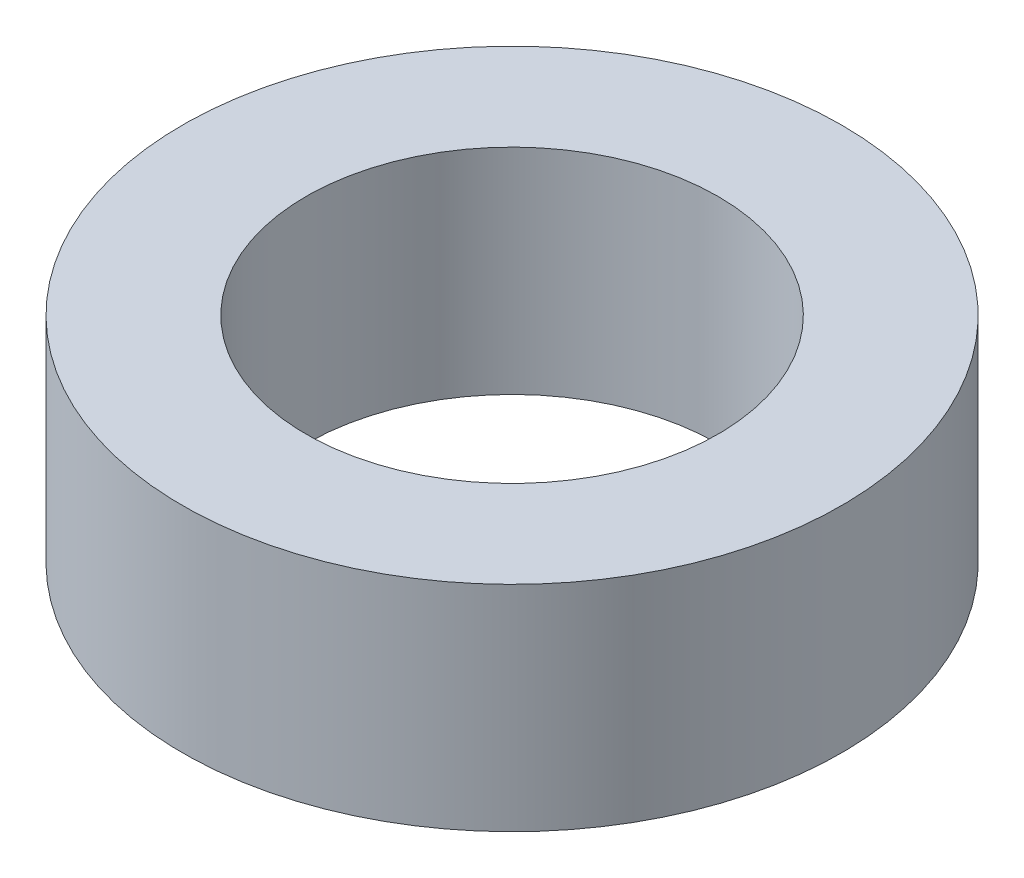
ISO-10303-21;
HEADER;
FILE_DESCRIPTION(('STEP AP214'),'2;1');
FILE_NAME('part.step','',(''),(''),'','','');
FILE_SCHEMA(('AUTOMOTIVE_DESIGN { 1 0 10303 214 1 1 1 1 }'));
ENDSEC;
DATA;
#1=APPLICATION_CONTEXT('core data for automotive mechanical design processes');
#2=APPLICATION_PROTOCOL_DEFINITION('international standard','automotive_design',2000,#1);
#3=PRODUCT_CONTEXT('',#1,'mechanical');
#4=PRODUCT('Part','Part','',(#3));
#5=PRODUCT_RELATED_PRODUCT_CATEGORY('part','',(#4));
#6=PRODUCT_DEFINITION_FORMATION('','',#4);
#7=PRODUCT_DEFINITION_CONTEXT('part definition',#1,'design');
#8=PRODUCT_DEFINITION('design','',#6,#7);
#9=PRODUCT_DEFINITION_SHAPE('','',#8);
#10=(LENGTH_UNIT() NAMED_UNIT(*) SI_UNIT(.MILLI.,.METRE.));
#11=(NAMED_UNIT(*) PLANE_ANGLE_UNIT() SI_UNIT($,.RADIAN.));
#12=(NAMED_UNIT(*) SI_UNIT($,.STERADIAN.) SOLID_ANGLE_UNIT());
#13=UNCERTAINTY_MEASURE_WITH_UNIT(LENGTH_MEASURE(1.E-05),#10,'distance_accuracy_value','');
#14=(GEOMETRIC_REPRESENTATION_CONTEXT(3) GLOBAL_UNCERTAINTY_ASSIGNED_CONTEXT((#13)) GLOBAL_UNIT_ASSIGNED_CONTEXT((#10,
#11,#12)) REPRESENTATION_CONTEXT('',''));
#15=CARTESIAN_POINT('',(0.,0.,0.));
#16=DIRECTION('',(0.,0.,1.));
#17=DIRECTION('',(1.,0.,0.));
#18=AXIS2_PLACEMENT_3D('',#15,#16,#17);
#19=CARTESIAN_POINT('',(0.,13.,0.));
#20=DIRECTION('',(0.,-1.,0.));
#21=DIRECTION('',(0.,0.,-1.));
#22=AXIS2_PLACEMENT_3D('',#19,#20,#21);
#23=CYLINDRICAL_SURFACE('',#22,20.);
#24=CARTESIAN_POINT('',(0.,13.,0.));
#25=DIRECTION('',(0.,1.,0.));
#26=DIRECTION('',(0.,0.,1.));
#27=AXIS2_PLACEMENT_3D('',#24,#25,#26);
#28=CIRCLE('',#27,20.);
#29=CARTESIAN_POINT('',(0.,13.,-20.));
#30=VERTEX_POINT('',#29);
#31=EDGE_CURVE('E10',#30,#30,#28,.T.);
#32=CARTESIAN_POINT('',(0.,0.,0.));
#33=DIRECTION('',(0.,1.,0.));
#34=DIRECTION('',(0.,0.,1.));
#35=AXIS2_PLACEMENT_3D('',#32,#33,#34);
#36=CIRCLE('',#35,20.);
#37=CARTESIAN_POINT('',(0.,0.,-20.));
#38=VERTEX_POINT('',#37);
#39=EDGE_CURVE('E37',#38,#38,#36,.T.);
#40=CARTESIAN_POINT('',(0.,13.,-20.));
#41=CARTESIAN_POINT('',(0.,12.8645833333333,-20.));
#42=CARTESIAN_POINT('',(0.,12.7291666666667,-20.));
#43=CARTESIAN_POINT('',(0.,12.4583333333333,-20.));
#44=CARTESIAN_POINT('',(0.,12.3229166666667,-20.));
#45=CARTESIAN_POINT('',(0.,12.0520833333333,-20.));
#46=CARTESIAN_POINT('',(0.,11.9166666666667,-20.));
#47=CARTESIAN_POINT('',(0.,11.6458333333333,-20.));
#48=CARTESIAN_POINT('',(0.,11.5104166666667,-20.));
#49=CARTESIAN_POINT('',(0.,11.2395833333333,-20.));
#50=CARTESIAN_POINT('',(0.,11.1041666666667,-20.));
#51=CARTESIAN_POINT('',(0.,10.8333333333333,-20.));
#52=CARTESIAN_POINT('',(0.,10.6979166666667,-20.));
#53=CARTESIAN_POINT('',(0.,10.4270833333333,-20.));
#54=CARTESIAN_POINT('',(0.,10.2916666666667,-20.));
#55=CARTESIAN_POINT('',(0.,10.0208333333333,-20.));
#56=CARTESIAN_POINT('',(0.,9.88541666666667,-20.));
#57=CARTESIAN_POINT('',(0.,9.61458333333333,-20.));
#58=CARTESIAN_POINT('',(0.,9.47916666666667,-20.));
#59=CARTESIAN_POINT('',(0.,9.20833333333333,-20.));
#60=CARTESIAN_POINT('',(0.,9.07291666666666,-20.));
#61=CARTESIAN_POINT('',(0.,8.80208333333333,-20.));
#62=CARTESIAN_POINT('',(0.,8.66666666666667,-20.));
#63=CARTESIAN_POINT('',(0.,8.39583333333333,-20.));
#64=CARTESIAN_POINT('',(0.,8.26041666666667,-20.));
#65=CARTESIAN_POINT('',(0.,7.98958333333333,-20.));
#66=CARTESIAN_POINT('',(0.,7.85416666666667,-20.));
#67=CARTESIAN_POINT('',(0.,7.58333333333333,-20.));
#68=CARTESIAN_POINT('',(0.,7.44791666666667,-20.));
#69=CARTESIAN_POINT('',(0.,7.17708333333333,-20.));
#70=CARTESIAN_POINT('',(0.,7.04166666666667,-20.));
#71=CARTESIAN_POINT('',(0.,6.77083333333333,-20.));
#72=CARTESIAN_POINT('',(0.,6.63541666666667,-20.));
#73=CARTESIAN_POINT('',(0.,6.36458333333333,-20.));
#74=CARTESIAN_POINT('',(0.,6.22916666666667,-20.));
#75=CARTESIAN_POINT('',(0.,5.95833333333333,-20.));
#76=CARTESIAN_POINT('',(0.,5.82291666666667,-20.));
#77=CARTESIAN_POINT('',(0.,5.55208333333333,-20.));
#78=CARTESIAN_POINT('',(0.,5.41666666666667,-20.));
#79=CARTESIAN_POINT('',(0.,5.14583333333333,-20.));
#80=CARTESIAN_POINT('',(0.,5.01041666666667,-20.));
#81=CARTESIAN_POINT('',(0.,4.73958333333333,-20.));
#82=CARTESIAN_POINT('',(0.,4.60416666666667,-20.));
#83=CARTESIAN_POINT('',(0.,4.33333333333333,-20.));
#84=CARTESIAN_POINT('',(0.,4.19791666666667,-20.));
#85=CARTESIAN_POINT('',(0.,3.92708333333333,-20.));
#86=CARTESIAN_POINT('',(0.,3.79166666666667,-20.));
#87=CARTESIAN_POINT('',(0.,3.52083333333333,-20.));
#88=CARTESIAN_POINT('',(0.,3.38541666666667,-20.));
#89=CARTESIAN_POINT('',(0.,3.11458333333333,-20.));
#90=CARTESIAN_POINT('',(0.,2.97916666666667,-20.));
#91=CARTESIAN_POINT('',(0.,2.70833333333333,-20.));
#92=CARTESIAN_POINT('',(0.,2.57291666666667,-20.));
#93=CARTESIAN_POINT('',(0.,2.30208333333333,-20.));
#94=CARTESIAN_POINT('',(0.,2.16666666666667,-20.));
#95=CARTESIAN_POINT('',(0.,1.89583333333333,-20.));
#96=CARTESIAN_POINT('',(0.,1.76041666666667,-20.));
#97=CARTESIAN_POINT('',(0.,1.48958333333333,-20.));
#98=CARTESIAN_POINT('',(0.,1.35416666666667,-20.));
#99=CARTESIAN_POINT('',(0.,1.08333333333333,-20.));
#100=CARTESIAN_POINT('',(0.,0.947916666666667,-20.));
#101=CARTESIAN_POINT('',(0.,0.677083333333334,-20.));
#102=CARTESIAN_POINT('',(0.,0.541666666666667,-20.));
#103=CARTESIAN_POINT('',(0.,0.270833333333334,-20.));
#104=CARTESIAN_POINT('',(0.,0.135416666666667,-20.));
#105=CARTESIAN_POINT('',(0.,0.,-20.));
#106=B_SPLINE_CURVE_WITH_KNOTS('',3,(#40,#41,#42,#43,#44,#45,#46,#47,#48,#49,#50,#51,#52,#53,
#54,#55,#56,#57,#58,#59,#60,#61,#62,#63,#64,#65,#66,#67,#68,#69,#70,#71,#72,#73,#74,#75,#76,#77,
#78,#79,#80,#81,#82,#83,#84,#85,#86,#87,#88,#89,#90,#91,#92,#93,#94,#95,#96,#97,#98,#99,#100,
#101,#102,#103,#104,#105),.UNSPECIFIED.,.F.,.F.,(4,2,2,2,2,2,2,2,2,2,2,2,2,2,2,2,2,2,2,2,2,2,2,
2,2,2,2,2,2,2,2,2,4),(0.,0.40625,0.812500000000001,1.21875,1.625,2.03125,2.4375,2.84375,3.25,
3.65625,4.0625,4.46875,4.875,5.28125,5.6875,6.09375,6.5,6.90625,7.3125,7.71875,8.125,8.53125,
8.9375,9.34375,9.75,10.15625,10.5625,10.96875,11.375,11.78125,12.1875,12.59375,13.),.UNSPECIFIED.);
#107=EDGE_CURVE('BSEAM40',#30,#38,#106,.T.);
#108=ORIENTED_EDGE('',*,*,#31,.F.);
#109=ORIENTED_EDGE('',*,*,#39,.T.);
#110=ORIENTED_EDGE('',*,*,#107,.T.);
#111=ORIENTED_EDGE('',*,*,#107,.F.);
#112=EDGE_LOOP('',(#108,#110,#109,#111));
#113=FACE_BOUND('',#112,.T.);
#114=ADVANCED_FACE('F40',(#113),#23,.T.);
#115=CARTESIAN_POINT('',(0.,13.,0.));
#116=DIRECTION('',(0.,1.,0.));
#117=DIRECTION('',(0.,0.,1.));
#118=AXIS2_PLACEMENT_3D('',#115,#116,#117);
#119=PLANE('',#118);
#120=CARTESIAN_POINT('',(0.,13.,0.));
#121=DIRECTION('',(0.,1.,0.));
#122=DIRECTION('',(0.,0.,1.));
#123=AXIS2_PLACEMENT_3D('',#120,#121,#122);
#124=CIRCLE('',#123,12.5);
#125=CARTESIAN_POINT('',(0.,13.,-12.5));
#126=VERTEX_POINT('',#125);
#127=EDGE_CURVE('E50',#126,#126,#124,.T.);
#128=ORIENTED_EDGE('',*,*,#127,.F.);
#129=EDGE_LOOP('',(#128));
#130=FACE_BOUND('',#129,.T.);
#131=ORIENTED_EDGE('',*,*,#31,.T.);
#132=EDGE_LOOP('',(#131));
#133=FACE_BOUND('',#132,.T.);
#134=ADVANCED_FACE('F59',(#130,#133),#119,.T.);
#135=CARTESIAN_POINT('',(0.,0.,0.));
#136=DIRECTION('',(0.,1.,0.));
#137=DIRECTION('',(0.,0.,1.));
#138=AXIS2_PLACEMENT_3D('',#135,#136,#137);
#139=PLANE('',#138);
#140=CARTESIAN_POINT('',(0.,0.,0.));
#141=DIRECTION('',(0.,1.,0.));
#142=DIRECTION('',(0.,0.,1.));
#143=AXIS2_PLACEMENT_3D('',#140,#141,#142);
#144=CIRCLE('',#143,12.5);
#145=CARTESIAN_POINT('',(0.,0.,-12.5));
#146=VERTEX_POINT('',#145);
#147=EDGE_CURVE('E47',#146,#146,#144,.T.);
#148=ORIENTED_EDGE('',*,*,#147,.T.);
#149=EDGE_LOOP('',(#148));
#150=FACE_BOUND('',#149,.T.);
#151=ORIENTED_EDGE('',*,*,#39,.F.);
#152=EDGE_LOOP('',(#151));
#153=FACE_BOUND('',#152,.T.);
#154=ADVANCED_FACE('F58',(#150,#153),#139,.F.);
#155=CARTESIAN_POINT('',(0.,13.,0.));
#156=DIRECTION('',(0.,-1.,0.));
#157=DIRECTION('',(0.,0.,-1.));
#158=AXIS2_PLACEMENT_3D('',#155,#156,#157);
#159=CYLINDRICAL_SURFACE('',#158,12.5);
#160=CARTESIAN_POINT('',(0.,13.,-12.5));
#161=CARTESIAN_POINT('',(0.,12.8645833333333,-12.5));
#162=CARTESIAN_POINT('',(0.,12.7291666666667,-12.5));
#163=CARTESIAN_POINT('',(0.,12.4583333333333,-12.5));
#164=CARTESIAN_POINT('',(0.,12.3229166666667,-12.5));
#165=CARTESIAN_POINT('',(0.,12.0520833333333,-12.5));
#166=CARTESIAN_POINT('',(0.,11.9166666666667,-12.5));
#167=CARTESIAN_POINT('',(0.,11.6458333333333,-12.5));
#168=CARTESIAN_POINT('',(0.,11.5104166666667,-12.5));
#169=CARTESIAN_POINT('',(0.,11.2395833333333,-12.5));
#170=CARTESIAN_POINT('',(0.,11.1041666666667,-12.5));
#171=CARTESIAN_POINT('',(0.,10.8333333333333,-12.5));
#172=CARTESIAN_POINT('',(0.,10.6979166666667,-12.5));
#173=CARTESIAN_POINT('',(0.,10.4270833333333,-12.5));
#174=CARTESIAN_POINT('',(0.,10.2916666666667,-12.5));
#175=CARTESIAN_POINT('',(0.,10.0208333333333,-12.5));
#176=CARTESIAN_POINT('',(0.,9.88541666666667,-12.5));
#177=CARTESIAN_POINT('',(0.,9.61458333333333,-12.5));
#178=CARTESIAN_POINT('',(0.,9.47916666666667,-12.5));
#179=CARTESIAN_POINT('',(0.,9.20833333333333,-12.5));
#180=CARTESIAN_POINT('',(0.,9.07291666666666,-12.5));
#181=CARTESIAN_POINT('',(0.,8.80208333333333,-12.5));
#182=CARTESIAN_POINT('',(0.,8.66666666666667,-12.5));
#183=CARTESIAN_POINT('',(0.,8.39583333333333,-12.5));
#184=CARTESIAN_POINT('',(0.,8.26041666666667,-12.5));
#185=CARTESIAN_POINT('',(0.,7.98958333333333,-12.5));
#186=CARTESIAN_POINT('',(0.,7.85416666666667,-12.5));
#187=CARTESIAN_POINT('',(0.,7.58333333333333,-12.5));
#188=CARTESIAN_POINT('',(0.,7.44791666666667,-12.5));
#189=CARTESIAN_POINT('',(0.,7.17708333333333,-12.5));
#190=CARTESIAN_POINT('',(0.,7.04166666666667,-12.5));
#191=CARTESIAN_POINT('',(0.,6.77083333333333,-12.5));
#192=CARTESIAN_POINT('',(0.,6.63541666666667,-12.5));
#193=CARTESIAN_POINT('',(0.,6.36458333333333,-12.5));
#194=CARTESIAN_POINT('',(0.,6.22916666666667,-12.5));
#195=CARTESIAN_POINT('',(0.,5.95833333333333,-12.5));
#196=CARTESIAN_POINT('',(0.,5.82291666666667,-12.5));
#197=CARTESIAN_POINT('',(0.,5.55208333333333,-12.5));
#198=CARTESIAN_POINT('',(0.,5.41666666666667,-12.5));
#199=CARTESIAN_POINT('',(0.,5.14583333333333,-12.5));
#200=CARTESIAN_POINT('',(0.,5.01041666666667,-12.5));
#201=CARTESIAN_POINT('',(0.,4.73958333333333,-12.5));
#202=CARTESIAN_POINT('',(0.,4.60416666666667,-12.5));
#203=CARTESIAN_POINT('',(0.,4.33333333333333,-12.5));
#204=CARTESIAN_POINT('',(0.,4.19791666666667,-12.5));
#205=CARTESIAN_POINT('',(0.,3.92708333333333,-12.5));
#206=CARTESIAN_POINT('',(0.,3.79166666666667,-12.5));
#207=CARTESIAN_POINT('',(0.,3.52083333333333,-12.5));
#208=CARTESIAN_POINT('',(0.,3.38541666666667,-12.5));
#209=CARTESIAN_POINT('',(0.,3.11458333333333,-12.5));
#210=CARTESIAN_POINT('',(0.,2.97916666666667,-12.5));
#211=CARTESIAN_POINT('',(0.,2.70833333333333,-12.5));
#212=CARTESIAN_POINT('',(0.,2.57291666666667,-12.5));
#213=CARTESIAN_POINT('',(0.,2.30208333333333,-12.5));
#214=CARTESIAN_POINT('',(0.,2.16666666666667,-12.5));
#215=CARTESIAN_POINT('',(0.,1.89583333333333,-12.5));
#216=CARTESIAN_POINT('',(0.,1.76041666666667,-12.5));
#217=CARTESIAN_POINT('',(0.,1.48958333333333,-12.5));
#218=CARTESIAN_POINT('',(0.,1.35416666666667,-12.5));
#219=CARTESIAN_POINT('',(0.,1.08333333333333,-12.5));
#220=CARTESIAN_POINT('',(0.,0.947916666666667,-12.5));
#221=CARTESIAN_POINT('',(0.,0.677083333333334,-12.5));
#222=CARTESIAN_POINT('',(0.,0.541666666666667,-12.5));
#223=CARTESIAN_POINT('',(0.,0.270833333333334,-12.5));
#224=CARTESIAN_POINT('',(0.,0.135416666666667,-12.5));
#225=CARTESIAN_POINT('',(0.,0.,-12.5));
#226=B_SPLINE_CURVE_WITH_KNOTS('',3,(#160,#161,#162,#163,#164,#165,#166,#167,#168,#169,#170,
#171,#172,#173,#174,#175,#176,#177,#178,#179,#180,#181,#182,#183,#184,#185,#186,#187,#188,#189,
#190,#191,#192,#193,#194,#195,#196,#197,#198,#199,#200,#201,#202,#203,#204,#205,#206,#207,#208,
#209,#210,#211,#212,#213,#214,#215,#216,#217,#218,#219,#220,#221,#222,#223,#224,#225),
.UNSPECIFIED.,.F.,.F.,(4,2,2,2,2,2,2,2,2,2,2,2,2,2,2,2,2,2,2,2,2,2,2,2,2,2,2,2,2,2,2,2,4),(0.,
0.40625,0.812500000000001,1.21875,1.625,2.03125,2.4375,2.84375,3.25,3.65625,4.0625,4.46875,
4.875,5.28125,5.6875,6.09375,6.5,6.90625,7.3125,7.71875,8.125,8.53125,8.9375,9.34375,9.75,
10.15625,10.5625,10.96875,11.375,11.78125,12.1875,12.59375,13.),.UNSPECIFIED.);
#227=EDGE_CURVE('BSEAM54',#126,#146,#226,.T.);
#228=ORIENTED_EDGE('',*,*,#127,.T.);
#229=ORIENTED_EDGE('',*,*,#147,.F.);
#230=ORIENTED_EDGE('',*,*,#227,.T.);
#231=ORIENTED_EDGE('',*,*,#227,.F.);
#232=EDGE_LOOP('',(#228,#230,#229,#231));
#233=FACE_BOUND('',#232,.T.);
#234=ADVANCED_FACE('F54',(#233),#159,.F.);
#235=CLOSED_SHELL('',(#114,#134,#154,#234));
#236=MANIFOLD_SOLID_BREP('B2',#235);
#237=ADVANCED_BREP_SHAPE_REPRESENTATION('',(#18,#236),#14);
#238=SHAPE_DEFINITION_REPRESENTATION(#9,#237);
ENDSEC;
END-ISO-10303-21;
